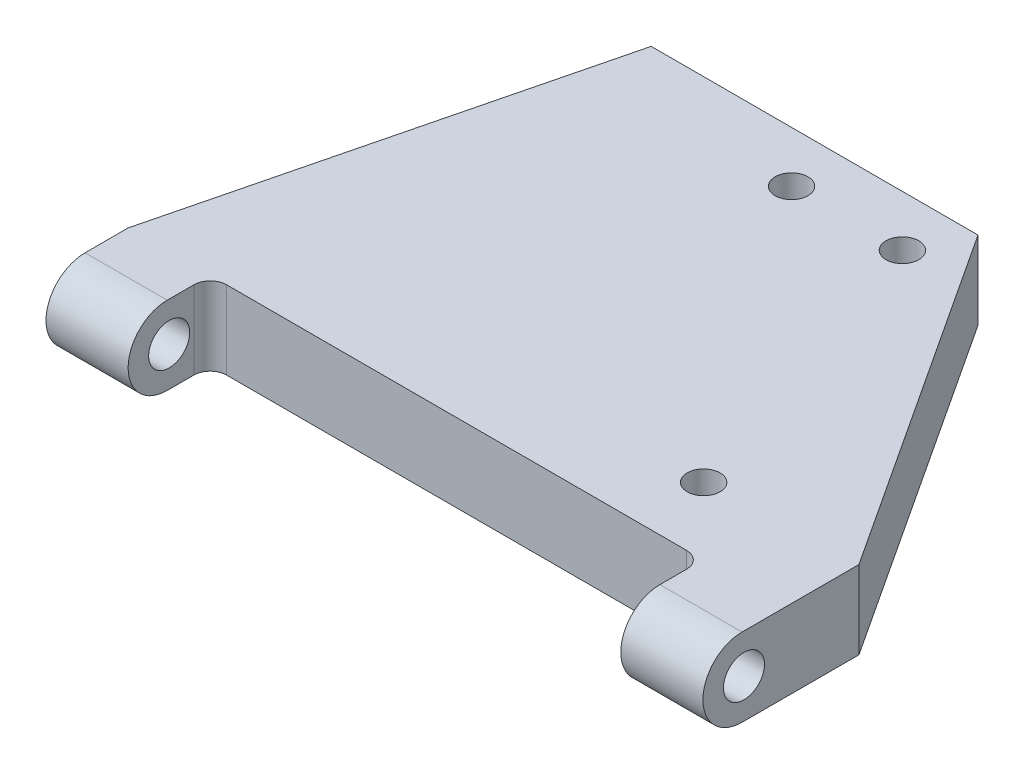
ISO-10303-21;
HEADER;
FILE_DESCRIPTION(('STEP AP214'),'2;1');
FILE_NAME('part.step','',(''),(''),'','','');
FILE_SCHEMA(('AUTOMOTIVE_DESIGN { 1 0 10303 214 1 1 1 1 }'));
ENDSEC;
DATA;
#1=APPLICATION_CONTEXT('core data for automotive mechanical design processes');
#2=APPLICATION_PROTOCOL_DEFINITION('international standard','automotive_design',2000,#1);
#3=PRODUCT_CONTEXT('',#1,'mechanical');
#4=PRODUCT('Part','Part','',(#3));
#5=PRODUCT_RELATED_PRODUCT_CATEGORY('part','',(#4));
#6=PRODUCT_DEFINITION_FORMATION('','',#4);
#7=PRODUCT_DEFINITION_CONTEXT('part definition',#1,'design');
#8=PRODUCT_DEFINITION('design','',#6,#7);
#9=PRODUCT_DEFINITION_SHAPE('','',#8);
#10=(LENGTH_UNIT() NAMED_UNIT(*) SI_UNIT(.MILLI.,.METRE.));
#11=(NAMED_UNIT(*) PLANE_ANGLE_UNIT() SI_UNIT($,.RADIAN.));
#12=(NAMED_UNIT(*) SI_UNIT($,.STERADIAN.) SOLID_ANGLE_UNIT());
#13=UNCERTAINTY_MEASURE_WITH_UNIT(LENGTH_MEASURE(1.E-05),#10,'distance_accuracy_value','');
#14=(GEOMETRIC_REPRESENTATION_CONTEXT(3) GLOBAL_UNCERTAINTY_ASSIGNED_CONTEXT((#13)) GLOBAL_UNIT_ASSIGNED_CONTEXT((#10,
#11,#12)) REPRESENTATION_CONTEXT('',''));
#15=CARTESIAN_POINT('',(0.,0.,0.));
#16=DIRECTION('',(0.,0.,1.));
#17=DIRECTION('',(1.,0.,0.));
#18=AXIS2_PLACEMENT_3D('',#15,#16,#17);
#19=CARTESIAN_POINT('',(140.,9.525,112.475));
#20=DIRECTION('',(1.,0.,0.));
#21=DIRECTION('',(0.,0.,-1.));
#22=AXIS2_PLACEMENT_3D('',#19,#20,#21);
#23=CYLINDRICAL_SURFACE('',#22,9.525);
#24=DIRECTION('',(-1.,0.,0.));
#25=VECTOR('',#24,1.);
#26=CARTESIAN_POINT('',(140.,19.05,112.475));
#27=LINE('',#26,#25);
#28=CARTESIAN_POINT('',(140.,19.05,112.475));
#29=VERTEX_POINT('',#28);
#30=CARTESIAN_POINT('',(160.,19.05,112.475));
#31=VERTEX_POINT('',#30);
#32=EDGE_CURVE('E296',#29,#31,#27,.F.);
#33=ORIENTED_EDGE('',*,*,#32,.F.);
#34=CARTESIAN_POINT('',(140.,9.525,112.475));
#35=DIRECTION('',(1.,0.,0.));
#36=DIRECTION('',(0.,0.,-1.));
#37=AXIS2_PLACEMENT_3D('',#34,#35,#36);
#38=CIRCLE('',#37,9.525);
#39=CARTESIAN_POINT('',(140.,0.,112.475));
#40=VERTEX_POINT('',#39);
#41=EDGE_CURVE('E121',#40,#29,#38,.F.);
#42=ORIENTED_EDGE('',*,*,#41,.F.);
#43=DIRECTION('',(1.,0.,0.));
#44=VECTOR('',#43,1.);
#45=CARTESIAN_POINT('',(0.,0.,112.475));
#46=LINE('',#45,#44);
#47=CARTESIAN_POINT('',(160.,0.,112.475));
#48=VERTEX_POINT('',#47);
#49=EDGE_CURVE('E299',#48,#40,#46,.F.);
#50=ORIENTED_EDGE('',*,*,#49,.F.);
#51=CARTESIAN_POINT('',(160.,9.525,112.475));
#52=DIRECTION('',(-1.,0.,0.));
#53=DIRECTION('',(0.,0.,1.));
#54=AXIS2_PLACEMENT_3D('',#51,#52,#53);
#55=CIRCLE('',#54,9.525);
#56=EDGE_CURVE('E12',#31,#48,#55,.F.);
#57=ORIENTED_EDGE('',*,*,#56,.F.);
#58=EDGE_LOOP('',(#33,#42,#50,#57));
#59=FACE_BOUND('',#58,.T.);
#60=ADVANCED_FACE('F113',(#59),#23,.T.);
#61=CARTESIAN_POINT('',(0.,9.525,112.475));
#62=DIRECTION('',(1.,0.,0.));
#63=DIRECTION('',(0.,0.,-1.));
#64=AXIS2_PLACEMENT_3D('',#61,#62,#63);
#65=CYLINDRICAL_SURFACE('',#64,9.525);
#66=DIRECTION('',(-1.,0.,0.));
#67=VECTOR('',#66,1.);
#68=CARTESIAN_POINT('',(0.,19.05,112.475));
#69=LINE('',#68,#67);
#70=CARTESIAN_POINT('',(0.,19.05,112.475));
#71=VERTEX_POINT('',#70);
#72=CARTESIAN_POINT('',(20.,19.05,112.475));
#73=VERTEX_POINT('',#72);
#74=EDGE_CURVE('E210',#71,#73,#69,.F.);
#75=ORIENTED_EDGE('',*,*,#74,.F.);
#76=CARTESIAN_POINT('',(0.,9.525,112.475));
#77=DIRECTION('',(1.,0.,0.));
#78=DIRECTION('',(0.,0.,-1.));
#79=AXIS2_PLACEMENT_3D('',#76,#77,#78);
#80=CIRCLE('',#79,9.525);
#81=CARTESIAN_POINT('',(0.,0.,112.475));
#82=VERTEX_POINT('',#81);
#83=EDGE_CURVE('E292',#82,#71,#80,.F.);
#84=ORIENTED_EDGE('',*,*,#83,.F.);
#85=DIRECTION('',(1.,0.,0.));
#86=VECTOR('',#85,1.);
#87=CARTESIAN_POINT('',(0.,0.,112.475));
#88=LINE('',#87,#86);
#89=CARTESIAN_POINT('',(20.,0.,112.475));
#90=VERTEX_POINT('',#89);
#91=EDGE_CURVE('E289',#90,#82,#88,.F.);
#92=ORIENTED_EDGE('',*,*,#91,.F.);
#93=CARTESIAN_POINT('',(20.,9.525,112.475));
#94=DIRECTION('',(1.,0.,0.));
#95=DIRECTION('',(0.,0.,-1.));
#96=AXIS2_PLACEMENT_3D('',#93,#94,#95);
#97=CIRCLE('',#96,9.525);
#98=EDGE_CURVE('E294',#73,#90,#97,.T.);
#99=ORIENTED_EDGE('',*,*,#98,.F.);
#100=EDGE_LOOP('',(#75,#84,#92,#99));
#101=FACE_BOUND('',#100,.T.);
#102=ADVANCED_FACE('F334',(#101),#65,.T.);
#103=CARTESIAN_POINT('',(0.,0.,0.));
#104=DIRECTION('',(0.,1.,0.));
#105=DIRECTION('',(0.,0.,1.));
#106=AXIS2_PLACEMENT_3D('',#103,#104,#105);
#107=PLANE('',#106);
#108=CARTESIAN_POINT('',(123.750569229122,0.,85.5773374277373));
#109=DIRECTION('',(0.,1.,0.));
#110=DIRECTION('',(0.,0.,1.));
#111=AXIS2_PLACEMENT_3D('',#108,#109,#110);
#112=CIRCLE('',#111,3.99999999999995);
#113=CARTESIAN_POINT('',(123.750569229122,0.,89.5773374277373));
#114=VERTEX_POINT('',#113);
#115=EDGE_CURVE('E439',#114,#114,#112,.T.);
#116=ORIENTED_EDGE('',*,*,#115,.T.);
#117=EDGE_LOOP('',(#116));
#118=FACE_BOUND('',#117,.T.);
#119=CARTESIAN_POINT('',(72.,0.,12.4141568321594));
#120=DIRECTION('',(0.,-1.,0.));
#121=DIRECTION('',(0.,0.,-1.));
#122=AXIS2_PLACEMENT_3D('',#119,#120,#121);
#123=CIRCLE('',#122,4.00000000000001);
#124=CARTESIAN_POINT('',(72.,0.,8.41415683215943));
#125=VERTEX_POINT('',#124);
#126=EDGE_CURVE('E448',#125,#125,#123,.T.);
#127=ORIENTED_EDGE('',*,*,#126,.F.);
#128=EDGE_LOOP('',(#127));
#129=FACE_BOUND('',#128,.T.);
#130=CARTESIAN_POINT('',(99.,0.,12.4141568321594));
#131=DIRECTION('',(0.,-1.,0.));
#132=DIRECTION('',(0.,0.,-1.));
#133=AXIS2_PLACEMENT_3D('',#130,#131,#132);
#134=CIRCLE('',#133,4.00000000000001);
#135=CARTESIAN_POINT('',(99.,0.,8.41415683215943));
#136=VERTEX_POINT('',#135);
#137=EDGE_CURVE('E398',#136,#136,#134,.T.);
#138=ORIENTED_EDGE('',*,*,#137,.F.);
#139=EDGE_LOOP('',(#138));
#140=FACE_BOUND('',#139,.T.);
#141=DIRECTION('',(0.,0.,-1.));
#142=VECTOR('',#141,1.);
#143=CARTESIAN_POINT('',(160.,0.,1.1686558153949E-13));
#144=LINE('',#143,#142);
#145=CARTESIAN_POINT('',(160.,0.,84.));
#146=VERTEX_POINT('',#145);
#147=EDGE_CURVE('E258',#48,#146,#144,.T.);
#148=ORIENTED_EDGE('',*,*,#147,.F.);
#149=ORIENTED_EDGE('',*,*,#49,.T.);
#150=DIRECTION('',(0.,0.,1.));
#151=VECTOR('',#150,1.);
#152=CARTESIAN_POINT('',(140.,0.,2.42861286636753E-13));
#153=LINE('',#152,#151);
#154=CARTESIAN_POINT('',(140.,0.,106.));
#155=VERTEX_POINT('',#154);
#156=EDGE_CURVE('E255',#155,#40,#153,.T.);
#157=ORIENTED_EDGE('',*,*,#156,.F.);
#158=CARTESIAN_POINT('',(136.,0.,106.));
#159=DIRECTION('',(0.,1.,0.));
#160=DIRECTION('',(0.,0.,1.));
#161=AXIS2_PLACEMENT_3D('',#158,#159,#160);
#162=CIRCLE('',#161,4.00000000000001);
#163=CARTESIAN_POINT('',(136.,0.,102.));
#164=VERTEX_POINT('',#163);
#165=EDGE_CURVE('E252',#164,#155,#162,.F.);
#166=ORIENTED_EDGE('',*,*,#165,.F.);
#167=DIRECTION('',(-1.,0.,0.));
#168=VECTOR('',#167,1.);
#169=CARTESIAN_POINT('',(0.,0.,102.));
#170=LINE('',#169,#168);
#171=CARTESIAN_POINT('',(24.,0.,102.));
#172=VERTEX_POINT('',#171);
#173=EDGE_CURVE('E249',#164,#172,#170,.T.);
#174=ORIENTED_EDGE('',*,*,#173,.T.);
#175=CARTESIAN_POINT('',(24.,0.,106.));
#176=DIRECTION('',(0.,1.,0.));
#177=DIRECTION('',(0.,0.,1.));
#178=AXIS2_PLACEMENT_3D('',#175,#176,#177);
#179=CIRCLE('',#178,4.00000000000001);
#180=CARTESIAN_POINT('',(20.,0.,106.));
#181=VERTEX_POINT('',#180);
#182=EDGE_CURVE('E205',#172,#181,#179,.T.);
#183=ORIENTED_EDGE('',*,*,#182,.T.);
#184=DIRECTION('',(0.,0.,1.));
#185=VECTOR('',#184,1.);
#186=CARTESIAN_POINT('',(20.,0.,0.));
#187=LINE('',#186,#185);
#188=EDGE_CURVE('E222',#181,#90,#187,.T.);
#189=ORIENTED_EDGE('',*,*,#188,.T.);
#190=ORIENTED_EDGE('',*,*,#91,.T.);
#191=DIRECTION('',(0.,0.,1.));
#192=VECTOR('',#191,1.);
#193=CARTESIAN_POINT('',(0.,0.,0.));
#194=LINE('',#193,#192);
#195=CARTESIAN_POINT('',(0.,0.,102.));
#196=VERTEX_POINT('',#195);
#197=EDGE_CURVE('E269',#196,#82,#194,.T.);
#198=ORIENTED_EDGE('',*,*,#197,.F.);
#199=DIRECTION('',(0.241640143717287,0.,-0.97036593146312));
#200=VECTOR('',#199,1.);
#201=CARTESIAN_POINT('',(23.9168950399849,0.,5.95577582368252));
#202=LINE('',#201,#200);
#203=CARTESIAN_POINT('',(25.4,0.,0.));
#204=VERTEX_POINT('',#203);
#205=EDGE_CURVE('E266',#196,#204,#202,.T.);
#206=ORIENTED_EDGE('',*,*,#205,.T.);
#207=DIRECTION('',(-1.,0.,0.));
#208=VECTOR('',#207,1.);
#209=CARTESIAN_POINT('',(0.,0.,0.));
#210=LINE('',#209,#208);
#211=CARTESIAN_POINT('',(105.,0.,0.));
#212=VERTEX_POINT('',#211);
#213=EDGE_CURVE('E263',#212,#204,#210,.T.);
#214=ORIENTED_EDGE('',*,*,#213,.F.);
#215=DIRECTION('',(0.547785941363776,0.,0.836618528628312));
#216=VECTOR('',#215,1.);
#217=CARTESIAN_POINT('',(73.4927090566412,0.,-48.1202261680389));
#218=LINE('',#217,#216);
#219=EDGE_CURVE('E260',#212,#146,#218,.T.);
#220=ORIENTED_EDGE('',*,*,#219,.T.);
#221=EDGE_LOOP('',(#148,#149,#157,#166,#174,#183,#189,#190,#198,#206,#214,#220));
#222=FACE_BOUND('',#221,.T.);
#223=ADVANCED_FACE('F308',(#118,#129,#140,#222),#107,.F.);
#224=CARTESIAN_POINT('',(140.,19.05,2.42861286636753E-13));
#225=DIRECTION('',(1.,0.,0.));
#226=DIRECTION('',(0.,0.,-1.));
#227=AXIS2_PLACEMENT_3D('',#224,#225,#226);
#228=PLANE('',#227);
#229=CARTESIAN_POINT('',(140.,9.525,112.));
#230=DIRECTION('',(1.,0.,0.));
#231=DIRECTION('',(0.,0.,-1.));
#232=AXIS2_PLACEMENT_3D('',#229,#230,#231);
#233=CIRCLE('',#232,5.);
#234=CARTESIAN_POINT('',(140.,9.525,107.));
#235=VERTEX_POINT('',#234);
#236=EDGE_CURVE('E392',#235,#235,#233,.T.);
#237=ORIENTED_EDGE('',*,*,#236,.T.);
#238=EDGE_LOOP('',(#237));
#239=FACE_BOUND('',#238,.T.);
#240=ORIENTED_EDGE('',*,*,#156,.T.);
#241=ORIENTED_EDGE('',*,*,#41,.T.);
#242=DIRECTION('',(0.,0.,1.));
#243=VECTOR('',#242,1.);
#244=CARTESIAN_POINT('',(140.,19.05,2.42861286636753E-13));
#245=LINE('',#244,#243);
#246=CARTESIAN_POINT('',(140.,19.05,106.));
#247=VERTEX_POINT('',#246);
#248=EDGE_CURVE('E228',#247,#29,#245,.T.);
#249=ORIENTED_EDGE('',*,*,#248,.F.);
#250=DIRECTION('',(0.,-1.,0.));
#251=VECTOR('',#250,1.);
#252=CARTESIAN_POINT('',(140.,19.05,106.));
#253=LINE('',#252,#251);
#254=EDGE_CURVE('E284',#247,#155,#253,.T.);
#255=ORIENTED_EDGE('',*,*,#254,.T.);
#256=EDGE_LOOP('',(#240,#241,#249,#255));
#257=FACE_BOUND('',#256,.T.);
#258=ADVANCED_FACE('F301',(#239,#257),#228,.F.);
#259=CARTESIAN_POINT('',(136.,19.05,106.));
#260=DIRECTION('',(0.,-1.,0.));
#261=DIRECTION('',(0.,0.,-1.));
#262=AXIS2_PLACEMENT_3D('',#259,#260,#261);
#263=CYLINDRICAL_SURFACE('',#262,4.00000000000001);
#264=ORIENTED_EDGE('',*,*,#165,.T.);
#265=ORIENTED_EDGE('',*,*,#254,.F.);
#266=CARTESIAN_POINT('',(136.,19.05,106.));
#267=DIRECTION('',(0.,1.,0.));
#268=DIRECTION('',(0.,0.,1.));
#269=AXIS2_PLACEMENT_3D('',#266,#267,#268);
#270=CIRCLE('',#269,4.00000000000001);
#271=CARTESIAN_POINT('',(136.,19.05,102.));
#272=VERTEX_POINT('',#271);
#273=EDGE_CURVE('E226',#272,#247,#270,.F.);
#274=ORIENTED_EDGE('',*,*,#273,.F.);
#275=DIRECTION('',(0.,-1.,0.));
#276=VECTOR('',#275,1.);
#277=CARTESIAN_POINT('',(136.,19.05,102.));
#278=LINE('',#277,#276);
#279=EDGE_CURVE('E211',#272,#164,#278,.T.);
#280=ORIENTED_EDGE('',*,*,#279,.T.);
#281=EDGE_LOOP('',(#264,#265,#274,#280));
#282=FACE_BOUND('',#281,.T.);
#283=ADVANCED_FACE('F304',(#282),#263,.F.);
#284=CARTESIAN_POINT('',(0.,19.05,102.));
#285=DIRECTION('',(0.,0.,1.));
#286=DIRECTION('',(1.,0.,0.));
#287=AXIS2_PLACEMENT_3D('',#284,#285,#286);
#288=PLANE('',#287);
#289=ORIENTED_EDGE('',*,*,#173,.F.);
#290=ORIENTED_EDGE('',*,*,#279,.F.);
#291=DIRECTION('',(-1.,0.,0.));
#292=VECTOR('',#291,1.);
#293=CARTESIAN_POINT('',(0.,19.05,102.));
#294=LINE('',#293,#292);
#295=CARTESIAN_POINT('',(24.,19.05,102.));
#296=VERTEX_POINT('',#295);
#297=EDGE_CURVE('E218',#272,#296,#294,.T.);
#298=ORIENTED_EDGE('',*,*,#297,.T.);
#299=DIRECTION('',(0.,-1.,0.));
#300=VECTOR('',#299,1.);
#301=CARTESIAN_POINT('',(24.,19.05,102.));
#302=LINE('',#301,#300);
#303=EDGE_CURVE('E199',#296,#172,#302,.T.);
#304=ORIENTED_EDGE('',*,*,#303,.T.);
#305=EDGE_LOOP('',(#289,#290,#298,#304));
#306=FACE_BOUND('',#305,.T.);
#307=ADVANCED_FACE('F224',(#306),#288,.T.);
#308=CARTESIAN_POINT('',(24.,19.05,106.));
#309=DIRECTION('',(0.,-1.,0.));
#310=DIRECTION('',(0.,0.,-1.));
#311=AXIS2_PLACEMENT_3D('',#308,#309,#310);
#312=CYLINDRICAL_SURFACE('',#311,4.00000000000001);
#313=ORIENTED_EDGE('',*,*,#182,.F.);
#314=ORIENTED_EDGE('',*,*,#303,.F.);
#315=CARTESIAN_POINT('',(24.,19.05,106.));
#316=DIRECTION('',(0.,1.,0.));
#317=DIRECTION('',(0.,0.,1.));
#318=AXIS2_PLACEMENT_3D('',#315,#316,#317);
#319=CIRCLE('',#318,4.00000000000001);
#320=CARTESIAN_POINT('',(20.,19.05,106.));
#321=VERTEX_POINT('',#320);
#322=EDGE_CURVE('E202',#296,#321,#319,.T.);
#323=ORIENTED_EDGE('',*,*,#322,.T.);
#324=DIRECTION('',(0.,-1.,0.));
#325=VECTOR('',#324,1.);
#326=CARTESIAN_POINT('',(20.,19.05,106.));
#327=LINE('',#326,#325);
#328=EDGE_CURVE('E247',#321,#181,#327,.T.);
#329=ORIENTED_EDGE('',*,*,#328,.T.);
#330=EDGE_LOOP('',(#313,#314,#323,#329));
#331=FACE_BOUND('',#330,.T.);
#332=ADVANCED_FACE('F201',(#331),#312,.F.);
#333=CARTESIAN_POINT('',(20.,19.05,0.));
#334=DIRECTION('',(1.,0.,0.));
#335=DIRECTION('',(0.,0.,-1.));
#336=AXIS2_PLACEMENT_3D('',#333,#334,#335);
#337=PLANE('',#336);
#338=CARTESIAN_POINT('',(20.,9.525,112.));
#339=DIRECTION('',(1.,0.,0.));
#340=DIRECTION('',(0.,0.,-1.));
#341=AXIS2_PLACEMENT_3D('',#338,#339,#340);
#342=CIRCLE('',#341,5.);
#343=CARTESIAN_POINT('',(20.,9.525,107.));
#344=VERTEX_POINT('',#343);
#345=EDGE_CURVE('E388',#344,#344,#342,.T.);
#346=ORIENTED_EDGE('',*,*,#345,.F.);
#347=EDGE_LOOP('',(#346));
#348=FACE_BOUND('',#347,.T.);
#349=DIRECTION('',(0.,0.,1.));
#350=VECTOR('',#349,1.);
#351=CARTESIAN_POINT('',(20.,19.05,0.));
#352=LINE('',#351,#350);
#353=EDGE_CURVE('E221',#321,#73,#352,.T.);
#354=ORIENTED_EDGE('',*,*,#353,.T.);
#355=ORIENTED_EDGE('',*,*,#98,.T.);
#356=ORIENTED_EDGE('',*,*,#188,.F.);
#357=ORIENTED_EDGE('',*,*,#328,.F.);
#358=EDGE_LOOP('',(#354,#355,#356,#357));
#359=FACE_BOUND('',#358,.T.);
#360=ADVANCED_FACE('F331',(#348,#359),#337,.T.);
#361=CARTESIAN_POINT('',(0.,19.05,0.));
#362=DIRECTION('',(1.,0.,0.));
#363=DIRECTION('',(0.,0.,-1.));
#364=AXIS2_PLACEMENT_3D('',#361,#362,#363);
#365=PLANE('',#364);
#366=CARTESIAN_POINT('',(0.,9.525,112.));
#367=DIRECTION('',(-1.,0.,0.));
#368=DIRECTION('',(0.,0.,1.));
#369=AXIS2_PLACEMENT_3D('',#366,#367,#368);
#370=CIRCLE('',#369,5.);
#371=CARTESIAN_POINT('',(0.,9.525,117.));
#372=VERTEX_POINT('',#371);
#373=EDGE_CURVE('E389',#372,#372,#370,.T.);
#374=ORIENTED_EDGE('',*,*,#373,.F.);
#375=EDGE_LOOP('',(#374));
#376=FACE_BOUND('',#375,.T.);
#377=ORIENTED_EDGE('',*,*,#197,.T.);
#378=ORIENTED_EDGE('',*,*,#83,.T.);
#379=DIRECTION('',(0.,0.,1.));
#380=VECTOR('',#379,1.);
#381=CARTESIAN_POINT('',(0.,19.05,0.));
#382=LINE('',#381,#380);
#383=CARTESIAN_POINT('',(0.,19.05,102.));
#384=VERTEX_POINT('',#383);
#385=EDGE_CURVE('E243',#384,#71,#382,.T.);
#386=ORIENTED_EDGE('',*,*,#385,.F.);
#387=DIRECTION('',(0.,-1.,0.));
#388=VECTOR('',#387,1.);
#389=CARTESIAN_POINT('',(0.,19.05,102.));
#390=LINE('',#389,#388);
#391=EDGE_CURVE('E275',#384,#196,#390,.T.);
#392=ORIENTED_EDGE('',*,*,#391,.T.);
#393=EDGE_LOOP('',(#377,#378,#386,#392));
#394=FACE_BOUND('',#393,.T.);
#395=ADVANCED_FACE('F327',(#376,#394),#365,.F.);
#396=CARTESIAN_POINT('',(23.9168950399849,19.05,5.95577582368252));
#397=DIRECTION('',(-0.97036593146312,0.,-0.241640143717287));
#398=DIRECTION('',(-0.241640143717287,0.,0.97036593146312));
#399=AXIS2_PLACEMENT_3D('',#396,#397,#398);
#400=PLANE('',#399);
#401=ORIENTED_EDGE('',*,*,#205,.F.);
#402=ORIENTED_EDGE('',*,*,#391,.F.);
#403=DIRECTION('',(0.241640143717287,0.,-0.97036593146312));
#404=VECTOR('',#403,1.);
#405=CARTESIAN_POINT('',(23.9168950399849,19.05,5.95577582368252));
#406=LINE('',#405,#404);
#407=CARTESIAN_POINT('',(25.4,19.05,0.));
#408=VERTEX_POINT('',#407);
#409=EDGE_CURVE('E240',#384,#408,#406,.T.);
#410=ORIENTED_EDGE('',*,*,#409,.T.);
#411=DIRECTION('',(0.,-1.,0.));
#412=VECTOR('',#411,1.);
#413=CARTESIAN_POINT('',(25.4,19.05,0.));
#414=LINE('',#413,#412);
#415=EDGE_CURVE('E277',#408,#204,#414,.T.);
#416=ORIENTED_EDGE('',*,*,#415,.T.);
#417=EDGE_LOOP('',(#401,#402,#410,#416));
#418=FACE_BOUND('',#417,.T.);
#419=ADVANCED_FACE('F323',(#418),#400,.T.);
#420=CARTESIAN_POINT('',(0.,19.05,0.));
#421=DIRECTION('',(0.,0.,1.));
#422=DIRECTION('',(1.,0.,0.));
#423=AXIS2_PLACEMENT_3D('',#420,#421,#422);
#424=PLANE('',#423);
#425=CARTESIAN_POINT('',(34.925,9.525,0.));
#426=DIRECTION('',(0.,0.,-1.));
#427=DIRECTION('',(-1.,0.,0.));
#428=AXIS2_PLACEMENT_3D('',#425,#426,#427);
#429=CIRCLE('',#428,3.96875);
#430=CARTESIAN_POINT('',(30.95625,9.525,0.));
#431=VERTEX_POINT('',#430);
#432=EDGE_CURVE('E402',#431,#431,#429,.T.);
#433=ORIENTED_EDGE('',*,*,#432,.F.);
#434=EDGE_LOOP('',(#433));
#435=FACE_BOUND('',#434,.T.);
#436=ORIENTED_EDGE('',*,*,#213,.T.);
#437=ORIENTED_EDGE('',*,*,#415,.F.);
#438=DIRECTION('',(-1.,0.,0.));
#439=VECTOR('',#438,1.);
#440=CARTESIAN_POINT('',(0.,19.05,0.));
#441=LINE('',#440,#439);
#442=CARTESIAN_POINT('',(105.,19.05,0.));
#443=VERTEX_POINT('',#442);
#444=EDGE_CURVE('E238',#443,#408,#441,.T.);
#445=ORIENTED_EDGE('',*,*,#444,.F.);
#446=DIRECTION('',(0.,-1.,0.));
#447=VECTOR('',#446,1.);
#448=CARTESIAN_POINT('',(105.,19.05,0.));
#449=LINE('',#448,#447);
#450=EDGE_CURVE('E279',#443,#212,#449,.T.);
#451=ORIENTED_EDGE('',*,*,#450,.T.);
#452=EDGE_LOOP('',(#436,#437,#445,#451));
#453=FACE_BOUND('',#452,.T.);
#454=ADVANCED_FACE('F320',(#435,#453),#424,.F.);
#455=CARTESIAN_POINT('',(73.4927090566412,19.05,-48.1202261680389));
#456=DIRECTION('',(0.836618528628312,0.,-0.547785941363776));
#457=DIRECTION('',(-0.547785941363776,0.,-0.836618528628312));
#458=AXIS2_PLACEMENT_3D('',#455,#456,#457);
#459=PLANE('',#458);
#460=ORIENTED_EDGE('',*,*,#219,.F.);
#461=ORIENTED_EDGE('',*,*,#450,.F.);
#462=DIRECTION('',(0.547785941363776,0.,0.836618528628312));
#463=VECTOR('',#462,1.);
#464=CARTESIAN_POINT('',(73.4927090566412,19.05,-48.1202261680389));
#465=LINE('',#464,#463);
#466=CARTESIAN_POINT('',(160.,19.05,84.));
#467=VERTEX_POINT('',#466);
#468=EDGE_CURVE('E235',#443,#467,#465,.T.);
#469=ORIENTED_EDGE('',*,*,#468,.T.);
#470=DIRECTION('',(0.,-1.,0.));
#471=VECTOR('',#470,1.);
#472=CARTESIAN_POINT('',(160.,19.05,84.));
#473=LINE('',#472,#471);
#474=EDGE_CURVE('E281',#467,#146,#473,.T.);
#475=ORIENTED_EDGE('',*,*,#474,.T.);
#476=EDGE_LOOP('',(#460,#461,#469,#475));
#477=FACE_BOUND('',#476,.T.);
#478=ADVANCED_FACE('F314',(#477),#459,.T.);
#479=CARTESIAN_POINT('',(160.,19.05,1.1686558153949E-13));
#480=DIRECTION('',(-1.,0.,0.));
#481=DIRECTION('',(0.,0.,1.));
#482=AXIS2_PLACEMENT_3D('',#479,#480,#481);
#483=PLANE('',#482);
#484=CARTESIAN_POINT('',(160.,9.525,112.));
#485=DIRECTION('',(-1.,0.,0.));
#486=DIRECTION('',(0.,0.,1.));
#487=AXIS2_PLACEMENT_3D('',#484,#485,#486);
#488=CIRCLE('',#487,5.);
#489=CARTESIAN_POINT('',(160.,9.525,117.));
#490=VERTEX_POINT('',#489);
#491=EDGE_CURVE('E386',#490,#490,#488,.T.);
#492=ORIENTED_EDGE('',*,*,#491,.T.);
#493=EDGE_LOOP('',(#492));
#494=FACE_BOUND('',#493,.T.);
#495=DIRECTION('',(0.,0.,-1.));
#496=VECTOR('',#495,1.);
#497=CARTESIAN_POINT('',(160.,19.05,1.1686558153949E-13));
#498=LINE('',#497,#496);
#499=EDGE_CURVE('E233',#31,#467,#498,.T.);
#500=ORIENTED_EDGE('',*,*,#499,.F.);
#501=ORIENTED_EDGE('',*,*,#56,.T.);
#502=ORIENTED_EDGE('',*,*,#147,.T.);
#503=ORIENTED_EDGE('',*,*,#474,.F.);
#504=EDGE_LOOP('',(#500,#501,#502,#503));
#505=FACE_BOUND('',#504,.T.);
#506=ADVANCED_FACE('F312',(#494,#505),#483,.F.);
#507=CARTESIAN_POINT('',(0.,19.05,0.));
#508=DIRECTION('',(0.,1.,0.));
#509=DIRECTION('',(0.,0.,1.));
#510=AXIS2_PLACEMENT_3D('',#507,#508,#509);
#511=PLANE('',#510);
#512=CARTESIAN_POINT('',(123.750569229122,19.05,85.5773374277373));
#513=DIRECTION('',(0.,1.,0.));
#514=DIRECTION('',(0.,0.,1.));
#515=AXIS2_PLACEMENT_3D('',#512,#513,#514);
#516=CIRCLE('',#515,3.99999999999995);
#517=CARTESIAN_POINT('',(123.750569229122,19.05,89.5773374277373));
#518=VERTEX_POINT('',#517);
#519=EDGE_CURVE('E442',#518,#518,#516,.T.);
#520=ORIENTED_EDGE('',*,*,#519,.F.);
#521=EDGE_LOOP('',(#520));
#522=FACE_BOUND('',#521,.T.);
#523=CARTESIAN_POINT('',(72.,19.05,12.4141568321594));
#524=DIRECTION('',(0.,-1.,0.));
#525=DIRECTION('',(0.,0.,-1.));
#526=AXIS2_PLACEMENT_3D('',#523,#524,#525);
#527=CIRCLE('',#526,4.00000000000001);
#528=CARTESIAN_POINT('',(72.,19.05,8.41415683215943));
#529=VERTEX_POINT('',#528);
#530=EDGE_CURVE('E395',#529,#529,#527,.T.);
#531=ORIENTED_EDGE('',*,*,#530,.T.);
#532=EDGE_LOOP('',(#531));
#533=FACE_BOUND('',#532,.T.);
#534=CARTESIAN_POINT('',(99.,19.05,12.4141568321594));
#535=DIRECTION('',(0.,-1.,0.));
#536=DIRECTION('',(0.,0.,-1.));
#537=AXIS2_PLACEMENT_3D('',#534,#535,#536);
#538=CIRCLE('',#537,4.00000000000001);
#539=CARTESIAN_POINT('',(99.,19.05,8.41415683215943));
#540=VERTEX_POINT('',#539);
#541=EDGE_CURVE('E450',#540,#540,#538,.T.);
#542=ORIENTED_EDGE('',*,*,#541,.T.);
#543=EDGE_LOOP('',(#542));
#544=FACE_BOUND('',#543,.T.);
#545=ORIENTED_EDGE('',*,*,#248,.T.);
#546=ORIENTED_EDGE('',*,*,#32,.T.);
#547=ORIENTED_EDGE('',*,*,#499,.T.);
#548=ORIENTED_EDGE('',*,*,#468,.F.);
#549=ORIENTED_EDGE('',*,*,#444,.T.);
#550=ORIENTED_EDGE('',*,*,#409,.F.);
#551=ORIENTED_EDGE('',*,*,#385,.T.);
#552=ORIENTED_EDGE('',*,*,#74,.T.);
#553=ORIENTED_EDGE('',*,*,#353,.F.);
#554=ORIENTED_EDGE('',*,*,#322,.F.);
#555=ORIENTED_EDGE('',*,*,#297,.F.);
#556=ORIENTED_EDGE('',*,*,#273,.T.);
#557=EDGE_LOOP('',(#545,#546,#547,#548,#549,#550,#551,#552,#553,#554,#555,#556));
#558=FACE_BOUND('',#557,.T.);
#559=ADVANCED_FACE('F216',(#522,#533,#544,#558),#511,.T.);
#560=CARTESIAN_POINT('',(34.925,9.525,38.1));
#561=DIRECTION('',(0.,0.,-1.));
#562=DIRECTION('',(-1.,0.,0.));
#563=AXIS2_PLACEMENT_3D('',#560,#561,#562);
#564=CYLINDRICAL_SURFACE('',#563,3.96875);
#565=CARTESIAN_POINT('',(34.925,9.525,38.1));
#566=DIRECTION('',(0.,0.,-1.));
#567=DIRECTION('',(-1.,0.,0.));
#568=AXIS2_PLACEMENT_3D('',#565,#566,#567);
#569=CIRCLE('',#568,3.96875);
#570=CARTESIAN_POINT('',(30.95625,9.525,38.1));
#571=VERTEX_POINT('',#570);
#572=EDGE_CURVE('E250',#571,#571,#569,.T.);
#573=CARTESIAN_POINT('',(30.95625,9.525,38.1));
#574=CARTESIAN_POINT('',(30.95625,9.525,37.703125));
#575=CARTESIAN_POINT('',(30.95625,9.525,37.30625));
#576=CARTESIAN_POINT('',(30.95625,9.525,36.5125));
#577=CARTESIAN_POINT('',(30.95625,9.525,36.115625));
#578=CARTESIAN_POINT('',(30.95625,9.525,35.321875));
#579=CARTESIAN_POINT('',(30.95625,9.525,34.925));
#580=CARTESIAN_POINT('',(30.95625,9.525,34.13125));
#581=CARTESIAN_POINT('',(30.95625,9.525,33.734375));
#582=CARTESIAN_POINT('',(30.95625,9.525,32.940625));
#583=CARTESIAN_POINT('',(30.95625,9.525,32.54375));
#584=CARTESIAN_POINT('',(30.95625,9.525,31.75));
#585=CARTESIAN_POINT('',(30.95625,9.525,31.353125));
#586=CARTESIAN_POINT('',(30.95625,9.525,30.559375));
#587=CARTESIAN_POINT('',(30.95625,9.525,30.1625));
#588=CARTESIAN_POINT('',(30.95625,9.525,29.36875));
#589=CARTESIAN_POINT('',(30.95625,9.525,28.971875));
#590=CARTESIAN_POINT('',(30.95625,9.525,28.178125));
#591=CARTESIAN_POINT('',(30.95625,9.525,27.78125));
#592=CARTESIAN_POINT('',(30.95625,9.525,26.9875));
#593=CARTESIAN_POINT('',(30.95625,9.525,26.590625));
#594=CARTESIAN_POINT('',(30.95625,9.525,25.796875));
#595=CARTESIAN_POINT('',(30.95625,9.525,25.4));
#596=CARTESIAN_POINT('',(30.95625,9.525,24.60625));
#597=CARTESIAN_POINT('',(30.95625,9.525,24.209375));
#598=CARTESIAN_POINT('',(30.95625,9.525,23.415625));
#599=CARTESIAN_POINT('',(30.95625,9.525,23.01875));
#600=CARTESIAN_POINT('',(30.95625,9.525,22.225));
#601=CARTESIAN_POINT('',(30.95625,9.525,21.828125));
#602=CARTESIAN_POINT('',(30.95625,9.525,21.034375));
#603=CARTESIAN_POINT('',(30.95625,9.525,20.6375));
#604=CARTESIAN_POINT('',(30.95625,9.525,19.84375));
#605=CARTESIAN_POINT('',(30.95625,9.525,19.446875));
#606=CARTESIAN_POINT('',(30.95625,9.525,18.653125));
#607=CARTESIAN_POINT('',(30.95625,9.525,18.25625));
#608=CARTESIAN_POINT('',(30.95625,9.525,17.4625));
#609=CARTESIAN_POINT('',(30.95625,9.525,17.065625));
#610=CARTESIAN_POINT('',(30.95625,9.525,16.271875));
#611=CARTESIAN_POINT('',(30.95625,9.525,15.875));
#612=CARTESIAN_POINT('',(30.95625,9.525,15.08125));
#613=CARTESIAN_POINT('',(30.95625,9.525,14.684375));
#614=CARTESIAN_POINT('',(30.95625,9.525,13.890625));
#615=CARTESIAN_POINT('',(30.95625,9.525,13.49375));
#616=CARTESIAN_POINT('',(30.95625,9.525,12.7));
#617=CARTESIAN_POINT('',(30.95625,9.525,12.303125));
#618=CARTESIAN_POINT('',(30.95625,9.525,11.509375));
#619=CARTESIAN_POINT('',(30.95625,9.525,11.1125));
#620=CARTESIAN_POINT('',(30.95625,9.525,10.31875));
#621=CARTESIAN_POINT('',(30.95625,9.525,9.92187499999999));
#622=CARTESIAN_POINT('',(30.95625,9.525,9.128125));
#623=CARTESIAN_POINT('',(30.95625,9.525,8.73124999999999));
#624=CARTESIAN_POINT('',(30.95625,9.525,7.93749999999999));
#625=CARTESIAN_POINT('',(30.95625,9.525,7.54062499999999));
#626=CARTESIAN_POINT('',(30.95625,9.525,6.74687499999999));
#627=CARTESIAN_POINT('',(30.95625,9.525,6.35));
#628=CARTESIAN_POINT('',(30.95625,9.525,5.55625));
#629=CARTESIAN_POINT('',(30.95625,9.525,5.159375));
#630=CARTESIAN_POINT('',(30.95625,9.525,4.365625));
#631=CARTESIAN_POINT('',(30.95625,9.525,3.96875));
#632=CARTESIAN_POINT('',(30.95625,9.525,3.17499999999999));
#633=CARTESIAN_POINT('',(30.95625,9.525,2.77812499999999));
#634=CARTESIAN_POINT('',(30.95625,9.525,1.98437499999999));
#635=CARTESIAN_POINT('',(30.95625,9.525,1.58749999999999));
#636=CARTESIAN_POINT('',(30.95625,9.525,0.793749999999994));
#637=CARTESIAN_POINT('',(30.95625,9.525,0.396874999999993));
#638=CARTESIAN_POINT('',(30.95625,9.525,0.));
#639=B_SPLINE_CURVE_WITH_KNOTS('',3,(#573,#574,#575,#576,#577,#578,#579,#580,#581,#582,#583,
#584,#585,#586,#587,#588,#589,#590,#591,#592,#593,#594,#595,#596,#597,#598,#599,#600,#601,#602,
#603,#604,#605,#606,#607,#608,#609,#610,#611,#612,#613,#614,#615,#616,#617,#618,#619,#620,#621,
#622,#623,#624,#625,#626,#627,#628,#629,#630,#631,#632,#633,#634,#635,#636,#637,#638),
.UNSPECIFIED.,.F.,.F.,(4,2,2,2,2,2,2,2,2,2,2,2,2,2,2,2,2,2,2,2,2,2,2,2,2,2,2,2,2,2,2,2,4),(0.,
1.19062499999999,2.38124999999999,3.571875,4.7625,5.953125,7.14375,8.334375,9.525,10.715625,
11.90625,13.096875,14.2875,15.478125,16.66875,17.859375,19.05,20.240625,21.43125,22.621875,
23.8125,25.003125,26.19375,27.384375,28.575,29.765625,30.95625,32.146875,33.3375,34.528125,
35.71875,36.909375,38.1),.UNSPECIFIED.);
#640=EDGE_CURVE('BSEAM382',#571,#431,#639,.T.);
#641=ORIENTED_EDGE('',*,*,#572,.F.);
#642=ORIENTED_EDGE('',*,*,#432,.T.);
#643=ORIENTED_EDGE('',*,*,#640,.T.);
#644=ORIENTED_EDGE('',*,*,#640,.F.);
#645=EDGE_LOOP('',(#641,#643,#642,#644));
#646=FACE_BOUND('',#645,.T.);
#647=ADVANCED_FACE('F382',(#646),#564,.F.);
#648=CARTESIAN_POINT('',(34.925,9.525,38.1));
#649=DIRECTION('',(0.,0.,-1.));
#650=DIRECTION('',(-1.,0.,0.));
#651=AXIS2_PLACEMENT_3D('',#648,#649,#650);
#652=PLANE('',#651);
#653=ORIENTED_EDGE('',*,*,#572,.T.);
#654=EDGE_LOOP('',(#653));
#655=FACE_BOUND('',#654,.T.);
#656=ADVANCED_FACE('F408',(#655),#652,.T.);
#657=CARTESIAN_POINT('',(160.,9.525,112.));
#658=DIRECTION('',(-1.,0.,0.));
#659=DIRECTION('',(0.,0.,1.));
#660=AXIS2_PLACEMENT_3D('',#657,#658,#659);
#661=CYLINDRICAL_SURFACE('',#660,5.);
#662=ORIENTED_EDGE('',*,*,#491,.F.);
#663=EDGE_LOOP('',(#662));
#664=FACE_BOUND('',#663,.T.);
#665=ORIENTED_EDGE('',*,*,#236,.F.);
#666=EDGE_LOOP('',(#665));
#667=FACE_BOUND('',#666,.T.);
#668=ADVANCED_FACE('F414',(#664,#667),#661,.F.);
#669=ORIENTED_EDGE('',*,*,#345,.T.);
#670=EDGE_LOOP('',(#669));
#671=FACE_BOUND('',#670,.T.);
#672=ORIENTED_EDGE('',*,*,#373,.T.);
#673=EDGE_LOOP('',(#672));
#674=FACE_BOUND('',#673,.T.);
#675=ADVANCED_FACE('F419',(#671,#674),#661,.F.);
#676=CARTESIAN_POINT('',(99.,19.05,12.4141568321594));
#677=DIRECTION('',(0.,-1.,0.));
#678=DIRECTION('',(0.,0.,-1.));
#679=AXIS2_PLACEMENT_3D('',#676,#677,#678);
#680=CYLINDRICAL_SURFACE('',#679,4.00000000000001);
#681=CARTESIAN_POINT('',(99.,19.05,8.41415683215943));
#682=CARTESIAN_POINT('',(99.,18.8515625,8.41415683215943));
#683=CARTESIAN_POINT('',(99.,18.653125,8.41415683215943));
#684=CARTESIAN_POINT('',(99.,18.25625,8.41415683215943));
#685=CARTESIAN_POINT('',(99.,18.0578125,8.41415683215943));
#686=CARTESIAN_POINT('',(99.,17.6609375,8.41415683215943));
#687=CARTESIAN_POINT('',(99.,17.4625,8.41415683215943));
#688=CARTESIAN_POINT('',(99.,17.065625,8.41415683215943));
#689=CARTESIAN_POINT('',(99.,16.8671875,8.41415683215943));
#690=CARTESIAN_POINT('',(99.,16.4703125,8.41415683215943));
#691=CARTESIAN_POINT('',(99.,16.271875,8.41415683215943));
#692=CARTESIAN_POINT('',(99.,15.875,8.41415683215943));
#693=CARTESIAN_POINT('',(99.,15.6765625,8.41415683215943));
#694=CARTESIAN_POINT('',(99.,15.2796875,8.41415683215943));
#695=CARTESIAN_POINT('',(99.,15.08125,8.41415683215943));
#696=CARTESIAN_POINT('',(99.,14.684375,8.41415683215943));
#697=CARTESIAN_POINT('',(99.,14.4859375,8.41415683215943));
#698=CARTESIAN_POINT('',(99.,14.0890625,8.41415683215943));
#699=CARTESIAN_POINT('',(99.,13.890625,8.41415683215943));
#700=CARTESIAN_POINT('',(99.,13.49375,8.41415683215943));
#701=CARTESIAN_POINT('',(99.,13.2953125,8.41415683215943));
#702=CARTESIAN_POINT('',(99.,12.8984375,8.41415683215943));
#703=CARTESIAN_POINT('',(99.,12.7,8.41415683215943));
#704=CARTESIAN_POINT('',(99.,12.303125,8.41415683215943));
#705=CARTESIAN_POINT('',(99.,12.1046875,8.41415683215943));
#706=CARTESIAN_POINT('',(99.,11.7078125,8.41415683215943));
#707=CARTESIAN_POINT('',(99.,11.509375,8.41415683215943));
#708=CARTESIAN_POINT('',(99.,11.1125,8.41415683215943));
#709=CARTESIAN_POINT('',(99.,10.9140625,8.41415683215943));
#710=CARTESIAN_POINT('',(99.,10.5171875,8.41415683215943));
#711=CARTESIAN_POINT('',(99.,10.31875,8.41415683215943));
#712=CARTESIAN_POINT('',(99.,9.921875,8.41415683215943));
#713=CARTESIAN_POINT('',(99.,9.7234375,8.41415683215943));
#714=CARTESIAN_POINT('',(99.,9.3265625,8.41415683215943));
#715=CARTESIAN_POINT('',(99.,9.128125,8.41415683215943));
#716=CARTESIAN_POINT('',(99.,8.73125,8.41415683215943));
#717=CARTESIAN_POINT('',(99.,8.5328125,8.41415683215943));
#718=CARTESIAN_POINT('',(99.,8.1359375,8.41415683215943));
#719=CARTESIAN_POINT('',(99.,7.9375,8.41415683215943));
#720=CARTESIAN_POINT('',(99.,7.540625,8.41415683215943));
#721=CARTESIAN_POINT('',(99.,7.3421875,8.41415683215943));
#722=CARTESIAN_POINT('',(99.,6.9453125,8.41415683215943));
#723=CARTESIAN_POINT('',(99.,6.746875,8.41415683215943));
#724=CARTESIAN_POINT('',(99.,6.35,8.41415683215943));
#725=CARTESIAN_POINT('',(99.,6.1515625,8.41415683215943));
#726=CARTESIAN_POINT('',(99.,5.7546875,8.41415683215943));
#727=CARTESIAN_POINT('',(99.,5.55625,8.41415683215943));
#728=CARTESIAN_POINT('',(99.,5.159375,8.41415683215943));
#729=CARTESIAN_POINT('',(99.,4.9609375,8.41415683215943));
#730=CARTESIAN_POINT('',(99.,4.5640625,8.41415683215943));
#731=CARTESIAN_POINT('',(99.,4.365625,8.41415683215943));
#732=CARTESIAN_POINT('',(99.,3.96875,8.41415683215943));
#733=CARTESIAN_POINT('',(99.,3.7703125,8.41415683215943));
#734=CARTESIAN_POINT('',(99.,3.3734375,8.41415683215943));
#735=CARTESIAN_POINT('',(99.,3.175,8.41415683215943));
#736=CARTESIAN_POINT('',(99.,2.778125,8.41415683215943));
#737=CARTESIAN_POINT('',(99.,2.5796875,8.41415683215943));
#738=CARTESIAN_POINT('',(99.,2.1828125,8.41415683215943));
#739=CARTESIAN_POINT('',(99.,1.984375,8.41415683215943));
#740=CARTESIAN_POINT('',(99.,1.5875,8.41415683215943));
#741=CARTESIAN_POINT('',(99.,1.3890625,8.41415683215943));
#742=CARTESIAN_POINT('',(99.,0.992187500000001,8.41415683215943));
#743=CARTESIAN_POINT('',(99.,0.793750000000001,8.41415683215943));
#744=CARTESIAN_POINT('',(99.,0.396875,8.41415683215943));
#745=CARTESIAN_POINT('',(99.,0.1984375,8.41415683215943));
#746=CARTESIAN_POINT('',(99.,0.,8.41415683215943));
#747=B_SPLINE_CURVE_WITH_KNOTS('',3,(#681,#682,#683,#684,#685,#686,#687,#688,#689,#690,#691,
#692,#693,#694,#695,#696,#697,#698,#699,#700,#701,#702,#703,#704,#705,#706,#707,#708,#709,#710,
#711,#712,#713,#714,#715,#716,#717,#718,#719,#720,#721,#722,#723,#724,#725,#726,#727,#728,#729,
#730,#731,#732,#733,#734,#735,#736,#737,#738,#739,#740,#741,#742,#743,#744,#745,#746),
.UNSPECIFIED.,.F.,.F.,(4,2,2,2,2,2,2,2,2,2,2,2,2,2,2,2,2,2,2,2,2,2,2,2,2,2,2,2,2,2,2,2,4),(0.,
0.5953125,1.190625,1.7859375,2.38125,2.9765625,3.571875,4.1671875,4.7625,5.3578125,5.953125,
6.5484375,7.14375,7.7390625,8.334375,8.9296875,9.525,10.1203125,10.715625,11.3109375,11.90625,
12.5015625,13.096875,13.6921875,14.2875,14.8828125,15.478125,16.0734375,16.66875,17.2640625,
17.859375,18.4546875,19.05),.UNSPECIFIED.);
#748=EDGE_CURVE('BSEAM422',#540,#136,#747,.T.);
#749=ORIENTED_EDGE('',*,*,#541,.F.);
#750=ORIENTED_EDGE('',*,*,#137,.T.);
#751=ORIENTED_EDGE('',*,*,#748,.T.);
#752=ORIENTED_EDGE('',*,*,#748,.F.);
#753=EDGE_LOOP('',(#749,#751,#750,#752));
#754=FACE_BOUND('',#753,.T.);
#755=ADVANCED_FACE('F422',(#754),#680,.F.);
#756=CARTESIAN_POINT('',(72.,19.05,12.4141568321594));
#757=DIRECTION('',(0.,-1.,0.));
#758=DIRECTION('',(0.,0.,-1.));
#759=AXIS2_PLACEMENT_3D('',#756,#757,#758);
#760=CYLINDRICAL_SURFACE('',#759,4.00000000000001);
#761=CARTESIAN_POINT('',(72.,19.05,8.41415683215943));
#762=CARTESIAN_POINT('',(72.,18.8515625,8.41415683215943));
#763=CARTESIAN_POINT('',(72.,18.653125,8.41415683215943));
#764=CARTESIAN_POINT('',(72.,18.25625,8.41415683215943));
#765=CARTESIAN_POINT('',(72.,18.0578125,8.41415683215943));
#766=CARTESIAN_POINT('',(72.,17.6609375,8.41415683215943));
#767=CARTESIAN_POINT('',(72.,17.4625,8.41415683215943));
#768=CARTESIAN_POINT('',(72.,17.065625,8.41415683215943));
#769=CARTESIAN_POINT('',(72.,16.8671875,8.41415683215943));
#770=CARTESIAN_POINT('',(72.,16.4703125,8.41415683215943));
#771=CARTESIAN_POINT('',(72.,16.271875,8.41415683215943));
#772=CARTESIAN_POINT('',(72.,15.875,8.41415683215943));
#773=CARTESIAN_POINT('',(72.,15.6765625,8.41415683215943));
#774=CARTESIAN_POINT('',(72.,15.2796875,8.41415683215943));
#775=CARTESIAN_POINT('',(72.,15.08125,8.41415683215943));
#776=CARTESIAN_POINT('',(72.,14.684375,8.41415683215943));
#777=CARTESIAN_POINT('',(72.,14.4859375,8.41415683215943));
#778=CARTESIAN_POINT('',(72.,14.0890625,8.41415683215943));
#779=CARTESIAN_POINT('',(72.,13.890625,8.41415683215943));
#780=CARTESIAN_POINT('',(72.,13.49375,8.41415683215943));
#781=CARTESIAN_POINT('',(72.,13.2953125,8.41415683215943));
#782=CARTESIAN_POINT('',(72.,12.8984375,8.41415683215943));
#783=CARTESIAN_POINT('',(72.,12.7,8.41415683215943));
#784=CARTESIAN_POINT('',(72.,12.303125,8.41415683215943));
#785=CARTESIAN_POINT('',(72.,12.1046875,8.41415683215943));
#786=CARTESIAN_POINT('',(72.,11.7078125,8.41415683215943));
#787=CARTESIAN_POINT('',(72.,11.509375,8.41415683215943));
#788=CARTESIAN_POINT('',(72.,11.1125,8.41415683215943));
#789=CARTESIAN_POINT('',(72.,10.9140625,8.41415683215943));
#790=CARTESIAN_POINT('',(72.,10.5171875,8.41415683215943));
#791=CARTESIAN_POINT('',(72.,10.31875,8.41415683215943));
#792=CARTESIAN_POINT('',(72.,9.921875,8.41415683215943));
#793=CARTESIAN_POINT('',(72.,9.7234375,8.41415683215943));
#794=CARTESIAN_POINT('',(72.,9.3265625,8.41415683215943));
#795=CARTESIAN_POINT('',(72.,9.128125,8.41415683215943));
#796=CARTESIAN_POINT('',(72.,8.73125,8.41415683215943));
#797=CARTESIAN_POINT('',(72.,8.5328125,8.41415683215943));
#798=CARTESIAN_POINT('',(72.,8.1359375,8.41415683215943));
#799=CARTESIAN_POINT('',(72.,7.9375,8.41415683215943));
#800=CARTESIAN_POINT('',(72.,7.540625,8.41415683215943));
#801=CARTESIAN_POINT('',(72.,7.3421875,8.41415683215943));
#802=CARTESIAN_POINT('',(72.,6.9453125,8.41415683215943));
#803=CARTESIAN_POINT('',(72.,6.746875,8.41415683215943));
#804=CARTESIAN_POINT('',(72.,6.35,8.41415683215943));
#805=CARTESIAN_POINT('',(72.,6.1515625,8.41415683215943));
#806=CARTESIAN_POINT('',(72.,5.7546875,8.41415683215943));
#807=CARTESIAN_POINT('',(72.,5.55625,8.41415683215943));
#808=CARTESIAN_POINT('',(72.,5.159375,8.41415683215943));
#809=CARTESIAN_POINT('',(72.,4.9609375,8.41415683215943));
#810=CARTESIAN_POINT('',(72.,4.5640625,8.41415683215943));
#811=CARTESIAN_POINT('',(72.,4.365625,8.41415683215943));
#812=CARTESIAN_POINT('',(72.,3.96875,8.41415683215943));
#813=CARTESIAN_POINT('',(72.,3.7703125,8.41415683215943));
#814=CARTESIAN_POINT('',(72.,3.3734375,8.41415683215943));
#815=CARTESIAN_POINT('',(72.,3.175,8.41415683215943));
#816=CARTESIAN_POINT('',(72.,2.778125,8.41415683215943));
#817=CARTESIAN_POINT('',(72.,2.5796875,8.41415683215943));
#818=CARTESIAN_POINT('',(72.,2.1828125,8.41415683215943));
#819=CARTESIAN_POINT('',(72.,1.984375,8.41415683215943));
#820=CARTESIAN_POINT('',(72.,1.5875,8.41415683215943));
#821=CARTESIAN_POINT('',(72.,1.3890625,8.41415683215943));
#822=CARTESIAN_POINT('',(72.,0.992187500000001,8.41415683215943));
#823=CARTESIAN_POINT('',(72.,0.793750000000001,8.41415683215943));
#824=CARTESIAN_POINT('',(72.,0.396875,8.41415683215943));
#825=CARTESIAN_POINT('',(72.,0.1984375,8.41415683215943));
#826=CARTESIAN_POINT('',(72.,0.,8.41415683215943));
#827=B_SPLINE_CURVE_WITH_KNOTS('',3,(#761,#762,#763,#764,#765,#766,#767,#768,#769,#770,#771,
#772,#773,#774,#775,#776,#777,#778,#779,#780,#781,#782,#783,#784,#785,#786,#787,#788,#789,#790,
#791,#792,#793,#794,#795,#796,#797,#798,#799,#800,#801,#802,#803,#804,#805,#806,#807,#808,#809,
#810,#811,#812,#813,#814,#815,#816,#817,#818,#819,#820,#821,#822,#823,#824,#825,#826),
.UNSPECIFIED.,.F.,.F.,(4,2,2,2,2,2,2,2,2,2,2,2,2,2,2,2,2,2,2,2,2,2,2,2,2,2,2,2,2,2,2,2,4),(0.,
0.5953125,1.190625,1.7859375,2.38125,2.9765625,3.571875,4.1671875,4.7625,5.3578125,5.953125,
6.5484375,7.14375,7.7390625,8.334375,8.9296875,9.525,10.1203125,10.715625,11.3109375,11.90625,
12.5015625,13.096875,13.6921875,14.2875,14.8828125,15.478125,16.0734375,16.66875,17.2640625,
17.859375,18.4546875,19.05),.UNSPECIFIED.);
#828=EDGE_CURVE('BSEAM426',#529,#125,#827,.T.);
#829=ORIENTED_EDGE('',*,*,#530,.F.);
#830=ORIENTED_EDGE('',*,*,#126,.T.);
#831=ORIENTED_EDGE('',*,*,#828,.T.);
#832=ORIENTED_EDGE('',*,*,#828,.F.);
#833=EDGE_LOOP('',(#829,#831,#830,#832));
#834=FACE_BOUND('',#833,.T.);
#835=ADVANCED_FACE('F426',(#834),#760,.F.);
#836=CARTESIAN_POINT('',(123.750569229122,0.,85.5773374277373));
#837=DIRECTION('',(0.,1.,0.));
#838=DIRECTION('',(0.,0.,1.));
#839=AXIS2_PLACEMENT_3D('',#836,#837,#838);
#840=CYLINDRICAL_SURFACE('',#839,3.99999999999995);
#841=CARTESIAN_POINT('',(123.750569229122,0.,89.5773374277373));
#842=CARTESIAN_POINT('',(123.750569229122,0.1984375,89.5773374277373));
#843=CARTESIAN_POINT('',(123.750569229122,0.396875,89.5773374277373));
#844=CARTESIAN_POINT('',(123.750569229122,0.79375,89.5773374277373));
#845=CARTESIAN_POINT('',(123.750569229122,0.9921875,89.5773374277373));
#846=CARTESIAN_POINT('',(123.750569229122,1.3890625,89.5773374277373));
#847=CARTESIAN_POINT('',(123.750569229122,1.5875,89.5773374277373));
#848=CARTESIAN_POINT('',(123.750569229122,1.984375,89.5773374277373));
#849=CARTESIAN_POINT('',(123.750569229122,2.1828125,89.5773374277373));
#850=CARTESIAN_POINT('',(123.750569229122,2.5796875,89.5773374277373));
#851=CARTESIAN_POINT('',(123.750569229122,2.778125,89.5773374277373));
#852=CARTESIAN_POINT('',(123.750569229122,3.175,89.5773374277373));
#853=CARTESIAN_POINT('',(123.750569229122,3.3734375,89.5773374277373));
#854=CARTESIAN_POINT('',(123.750569229122,3.7703125,89.5773374277373));
#855=CARTESIAN_POINT('',(123.750569229122,3.96875,89.5773374277373));
#856=CARTESIAN_POINT('',(123.750569229122,4.365625,89.5773374277373));
#857=CARTESIAN_POINT('',(123.750569229122,4.5640625,89.5773374277373));
#858=CARTESIAN_POINT('',(123.750569229122,4.9609375,89.5773374277373));
#859=CARTESIAN_POINT('',(123.750569229122,5.159375,89.5773374277373));
#860=CARTESIAN_POINT('',(123.750569229122,5.55625,89.5773374277373));
#861=CARTESIAN_POINT('',(123.750569229122,5.7546875,89.5773374277373));
#862=CARTESIAN_POINT('',(123.750569229122,6.1515625,89.5773374277373));
#863=CARTESIAN_POINT('',(123.750569229122,6.35,89.5773374277373));
#864=CARTESIAN_POINT('',(123.750569229122,6.746875,89.5773374277373));
#865=CARTESIAN_POINT('',(123.750569229122,6.9453125,89.5773374277373));
#866=CARTESIAN_POINT('',(123.750569229122,7.3421875,89.5773374277373));
#867=CARTESIAN_POINT('',(123.750569229122,7.540625,89.5773374277373));
#868=CARTESIAN_POINT('',(123.750569229122,7.9375,89.5773374277373));
#869=CARTESIAN_POINT('',(123.750569229122,8.1359375,89.5773374277373));
#870=CARTESIAN_POINT('',(123.750569229122,8.5328125,89.5773374277373));
#871=CARTESIAN_POINT('',(123.750569229122,8.73125,89.5773374277373));
#872=CARTESIAN_POINT('',(123.750569229122,9.128125,89.5773374277373));
#873=CARTESIAN_POINT('',(123.750569229122,9.3265625,89.5773374277373));
#874=CARTESIAN_POINT('',(123.750569229122,9.7234375,89.5773374277373));
#875=CARTESIAN_POINT('',(123.750569229122,9.921875,89.5773374277373));
#876=CARTESIAN_POINT('',(123.750569229122,10.31875,89.5773374277373));
#877=CARTESIAN_POINT('',(123.750569229122,10.5171875,89.5773374277373));
#878=CARTESIAN_POINT('',(123.750569229122,10.9140625,89.5773374277373));
#879=CARTESIAN_POINT('',(123.750569229122,11.1125,89.5773374277373));
#880=CARTESIAN_POINT('',(123.750569229122,11.509375,89.5773374277373));
#881=CARTESIAN_POINT('',(123.750569229122,11.7078125,89.5773374277373));
#882=CARTESIAN_POINT('',(123.750569229122,12.1046875,89.5773374277373));
#883=CARTESIAN_POINT('',(123.750569229122,12.303125,89.5773374277373));
#884=CARTESIAN_POINT('',(123.750569229122,12.7,89.5773374277373));
#885=CARTESIAN_POINT('',(123.750569229122,12.8984375,89.5773374277373));
#886=CARTESIAN_POINT('',(123.750569229122,13.2953125,89.5773374277373));
#887=CARTESIAN_POINT('',(123.750569229122,13.49375,89.5773374277373));
#888=CARTESIAN_POINT('',(123.750569229122,13.890625,89.5773374277373));
#889=CARTESIAN_POINT('',(123.750569229122,14.0890625,89.5773374277373));
#890=CARTESIAN_POINT('',(123.750569229122,14.4859375,89.5773374277373));
#891=CARTESIAN_POINT('',(123.750569229122,14.684375,89.5773374277373));
#892=CARTESIAN_POINT('',(123.750569229122,15.08125,89.5773374277373));
#893=CARTESIAN_POINT('',(123.750569229122,15.2796875,89.5773374277373));
#894=CARTESIAN_POINT('',(123.750569229122,15.6765625,89.5773374277373));
#895=CARTESIAN_POINT('',(123.750569229122,15.875,89.5773374277373));
#896=CARTESIAN_POINT('',(123.750569229122,16.271875,89.5773374277373));
#897=CARTESIAN_POINT('',(123.750569229122,16.4703125,89.5773374277373));
#898=CARTESIAN_POINT('',(123.750569229122,16.8671875,89.5773374277373));
#899=CARTESIAN_POINT('',(123.750569229122,17.065625,89.5773374277373));
#900=CARTESIAN_POINT('',(123.750569229122,17.4625,89.5773374277373));
#901=CARTESIAN_POINT('',(123.750569229122,17.6609375,89.5773374277373));
#902=CARTESIAN_POINT('',(123.750569229122,18.0578125,89.5773374277373));
#903=CARTESIAN_POINT('',(123.750569229122,18.25625,89.5773374277373));
#904=CARTESIAN_POINT('',(123.750569229122,18.653125,89.5773374277373));
#905=CARTESIAN_POINT('',(123.750569229122,18.8515625,89.5773374277373));
#906=CARTESIAN_POINT('',(123.750569229122,19.05,89.5773374277373));
#907=B_SPLINE_CURVE_WITH_KNOTS('',3,(#841,#842,#843,#844,#845,#846,#847,#848,#849,#850,#851,
#852,#853,#854,#855,#856,#857,#858,#859,#860,#861,#862,#863,#864,#865,#866,#867,#868,#869,#870,
#871,#872,#873,#874,#875,#876,#877,#878,#879,#880,#881,#882,#883,#884,#885,#886,#887,#888,#889,
#890,#891,#892,#893,#894,#895,#896,#897,#898,#899,#900,#901,#902,#903,#904,#905,#906),
.UNSPECIFIED.,.F.,.F.,(4,2,2,2,2,2,2,2,2,2,2,2,2,2,2,2,2,2,2,2,2,2,2,2,2,2,2,2,2,2,2,2,4),(0.,
0.5953125,1.190625,1.7859375,2.38125,2.9765625,3.571875,4.1671875,4.7625,5.3578125,5.953125,
6.5484375,7.14375,7.7390625,8.334375,8.9296875,9.525,10.1203125,10.715625,11.3109375,11.90625,
12.5015625,13.096875,13.6921875,14.2875,14.8828125,15.478125,16.0734375,16.66875,17.2640625,
17.859375,18.4546875,19.05),.UNSPECIFIED.);
#908=EDGE_CURVE('BSEAM430',#114,#518,#907,.T.);
#909=ORIENTED_EDGE('',*,*,#115,.F.);
#910=ORIENTED_EDGE('',*,*,#519,.T.);
#911=ORIENTED_EDGE('',*,*,#908,.T.);
#912=ORIENTED_EDGE('',*,*,#908,.F.);
#913=EDGE_LOOP('',(#909,#911,#910,#912));
#914=FACE_BOUND('',#913,.T.);
#915=ADVANCED_FACE('F430',(#914),#840,.F.);
#916=CLOSED_SHELL('',(#60,#102,#223,#258,#283,#307,#332,#360,#395,#419,#454,#478,#506,#559,#647,
#656,#668,#675,#755,#835,#915));
#917=MANIFOLD_SOLID_BREP('B2',#916);
#918=ADVANCED_BREP_SHAPE_REPRESENTATION('',(#18,#917),#14);
#919=SHAPE_DEFINITION_REPRESENTATION(#9,#918);
ENDSEC;
END-ISO-10303-21;
